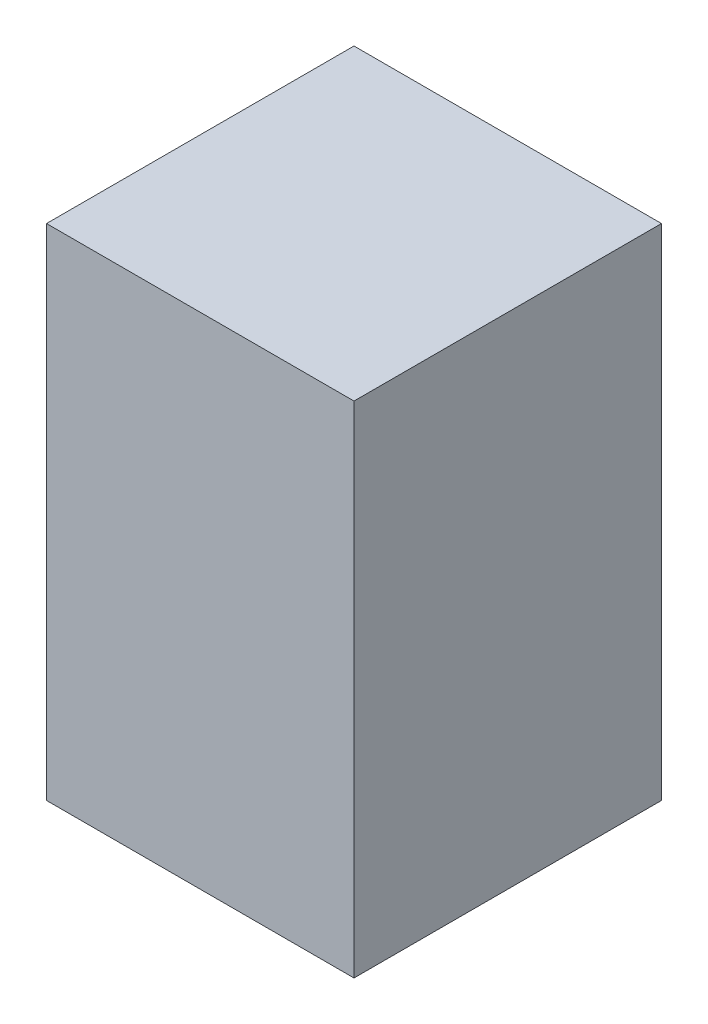
ISO-10303-21;
HEADER;
FILE_DESCRIPTION(('STEP AP214'),'2;1');
FILE_NAME('part.step','',(''),(''),'','','');
FILE_SCHEMA(('AUTOMOTIVE_DESIGN { 1 0 10303 214 1 1 1 1 }'));
ENDSEC;
DATA;
#1=APPLICATION_CONTEXT('core data for automotive mechanical design processes');
#2=APPLICATION_PROTOCOL_DEFINITION('international standard','automotive_design',2000,#1);
#3=PRODUCT_CONTEXT('',#1,'mechanical');
#4=PRODUCT('Part','Part','',(#3));
#5=PRODUCT_RELATED_PRODUCT_CATEGORY('part','',(#4));
#6=PRODUCT_DEFINITION_FORMATION('','',#4);
#7=PRODUCT_DEFINITION_CONTEXT('part definition',#1,'design');
#8=PRODUCT_DEFINITION('design','',#6,#7);
#9=PRODUCT_DEFINITION_SHAPE('','',#8);
#10=(LENGTH_UNIT() NAMED_UNIT(*) SI_UNIT(.MILLI.,.METRE.));
#11=(NAMED_UNIT(*) PLANE_ANGLE_UNIT() SI_UNIT($,.RADIAN.));
#12=(NAMED_UNIT(*) SI_UNIT($,.STERADIAN.) SOLID_ANGLE_UNIT());
#13=UNCERTAINTY_MEASURE_WITH_UNIT(LENGTH_MEASURE(1.E-05),#10,'distance_accuracy_value','');
#14=(GEOMETRIC_REPRESENTATION_CONTEXT(3) GLOBAL_UNCERTAINTY_ASSIGNED_CONTEXT((#13)) GLOBAL_UNIT_ASSIGNED_CONTEXT((#10,
#11,#12)) REPRESENTATION_CONTEXT('',''));
#15=CARTESIAN_POINT('',(0.,0.,0.));
#16=DIRECTION('',(0.,0.,1.));
#17=DIRECTION('',(1.,0.,0.));
#18=AXIS2_PLACEMENT_3D('',#15,#16,#17);
#19=CARTESIAN_POINT('',(-36.4561960120921,660.4,-352.08173204624));
#20=DIRECTION('',(1.,0.,0.));
#21=DIRECTION('',(0.,0.,-1.));
#22=AXIS2_PLACEMENT_3D('',#19,#20,#21);
#23=PLANE('',#22);
#24=DIRECTION('',(0.,0.,1.));
#25=VECTOR('',#24,1.);
#26=CARTESIAN_POINT('',(-36.4561960120921,0.,-352.08173204624));
#27=LINE('',#26,#25);
#28=CARTESIAN_POINT('',(-36.4561960120921,0.,-352.08173204624));
#29=VERTEX_POINT('',#28);
#30=CARTESIAN_POINT('',(-36.456196012092,0.,54.3182679537596));
#31=VERTEX_POINT('',#30);
#32=EDGE_CURVE('E94',#29,#31,#27,.T.);
#33=ORIENTED_EDGE('',*,*,#32,.T.);
#34=DIRECTION('',(0.,-1.,0.));
#35=VECTOR('',#34,1.);
#36=CARTESIAN_POINT('',(-36.456196012092,660.4,54.3182679537596));
#37=LINE('',#36,#35);
#38=CARTESIAN_POINT('',(-36.456196012092,660.4,54.3182679537596));
#39=VERTEX_POINT('',#38);
#40=EDGE_CURVE('E11',#39,#31,#37,.T.);
#41=ORIENTED_EDGE('',*,*,#40,.F.);
#42=DIRECTION('',(0.,0.,1.));
#43=VECTOR('',#42,1.);
#44=CARTESIAN_POINT('',(-36.4561960120921,660.4,-352.08173204624));
#45=LINE('',#44,#43);
#46=CARTESIAN_POINT('',(-36.4561960120921,660.4,-352.08173204624));
#47=VERTEX_POINT('',#46);
#48=EDGE_CURVE('E82',#47,#39,#45,.T.);
#49=ORIENTED_EDGE('',*,*,#48,.F.);
#50=DIRECTION('',(0.,-1.,0.));
#51=VECTOR('',#50,1.);
#52=CARTESIAN_POINT('',(-36.4561960120921,660.4,-352.08173204624));
#53=LINE('',#52,#51);
#54=EDGE_CURVE('E90',#47,#29,#53,.T.);
#55=ORIENTED_EDGE('',*,*,#54,.T.);
#56=EDGE_LOOP('',(#33,#41,#49,#55));
#57=FACE_BOUND('',#56,.T.);
#58=ADVANCED_FACE('F31',(#57),#23,.F.);
#59=CARTESIAN_POINT('',(-36.456196012092,660.4,54.3182679537596));
#60=DIRECTION('',(0.,0.,-1.));
#61=DIRECTION('',(-1.,0.,0.));
#62=AXIS2_PLACEMENT_3D('',#59,#60,#61);
#63=PLANE('',#62);
#64=DIRECTION('',(1.,0.,0.));
#65=VECTOR('',#64,1.);
#66=CARTESIAN_POINT('',(-36.456196012092,0.,54.3182679537596));
#67=LINE('',#66,#65);
#68=CARTESIAN_POINT('',(369.943803987908,0.,54.3182679537596));
#69=VERTEX_POINT('',#68);
#70=EDGE_CURVE('E86',#31,#69,#67,.T.);
#71=ORIENTED_EDGE('',*,*,#70,.T.);
#72=DIRECTION('',(0.,-1.,0.));
#73=VECTOR('',#72,1.);
#74=CARTESIAN_POINT('',(369.943803987908,660.4,54.3182679537596));
#75=LINE('',#74,#73);
#76=CARTESIAN_POINT('',(369.943803987908,660.4,54.3182679537596));
#77=VERTEX_POINT('',#76);
#78=EDGE_CURVE('E39',#77,#69,#75,.T.);
#79=ORIENTED_EDGE('',*,*,#78,.F.);
#80=DIRECTION('',(1.,0.,0.));
#81=VECTOR('',#80,1.);
#82=CARTESIAN_POINT('',(-36.456196012092,660.4,54.3182679537596));
#83=LINE('',#82,#81);
#84=EDGE_CURVE('E77',#39,#77,#83,.T.);
#85=ORIENTED_EDGE('',*,*,#84,.F.);
#86=ORIENTED_EDGE('',*,*,#40,.T.);
#87=EDGE_LOOP('',(#71,#79,#85,#86));
#88=FACE_BOUND('',#87,.T.);
#89=ADVANCED_FACE('F85',(#88),#63,.F.);
#90=CARTESIAN_POINT('',(369.943803987908,660.4,-352.08173204624));
#91=DIRECTION('',(-1.,0.,0.));
#92=DIRECTION('',(0.,0.,1.));
#93=AXIS2_PLACEMENT_3D('',#90,#91,#92);
#94=PLANE('',#93);
#95=DIRECTION('',(0.,0.,-1.));
#96=VECTOR('',#95,1.);
#97=CARTESIAN_POINT('',(369.943803987908,0.,-352.08173204624));
#98=LINE('',#97,#96);
#99=CARTESIAN_POINT('',(369.943803987908,0.,-352.08173204624));
#100=VERTEX_POINT('',#99);
#101=EDGE_CURVE('E64',#69,#100,#98,.T.);
#102=ORIENTED_EDGE('',*,*,#101,.T.);
#103=DIRECTION('',(0.,-1.,0.));
#104=VECTOR('',#103,1.);
#105=CARTESIAN_POINT('',(369.943803987908,660.4,-352.08173204624));
#106=LINE('',#105,#104);
#107=CARTESIAN_POINT('',(369.943803987908,660.4,-352.08173204624));
#108=VERTEX_POINT('',#107);
#109=EDGE_CURVE('E87',#108,#100,#106,.T.);
#110=ORIENTED_EDGE('',*,*,#109,.F.);
#111=DIRECTION('',(0.,0.,-1.));
#112=VECTOR('',#111,1.);
#113=CARTESIAN_POINT('',(369.943803987908,660.4,-352.08173204624));
#114=LINE('',#113,#112);
#115=EDGE_CURVE('E80',#77,#108,#114,.T.);
#116=ORIENTED_EDGE('',*,*,#115,.F.);
#117=ORIENTED_EDGE('',*,*,#78,.T.);
#118=EDGE_LOOP('',(#102,#110,#116,#117));
#119=FACE_BOUND('',#118,.T.);
#120=ADVANCED_FACE('F88',(#119),#94,.F.);
#121=CARTESIAN_POINT('',(-36.4561960120921,660.4,-352.08173204624));
#122=DIRECTION('',(0.,0.,1.));
#123=DIRECTION('',(1.,0.,0.));
#124=AXIS2_PLACEMENT_3D('',#121,#122,#123);
#125=PLANE('',#124);
#126=DIRECTION('',(-1.,0.,0.));
#127=VECTOR('',#126,1.);
#128=CARTESIAN_POINT('',(-36.4561960120921,0.,-352.08173204624));
#129=LINE('',#128,#127);
#130=EDGE_CURVE('E70',#100,#29,#129,.T.);
#131=ORIENTED_EDGE('',*,*,#130,.T.);
#132=ORIENTED_EDGE('',*,*,#54,.F.);
#133=DIRECTION('',(-1.,0.,0.));
#134=VECTOR('',#133,1.);
#135=CARTESIAN_POINT('',(-36.4561960120921,660.4,-352.08173204624));
#136=LINE('',#135,#134);
#137=EDGE_CURVE('E47',#108,#47,#136,.T.);
#138=ORIENTED_EDGE('',*,*,#137,.F.);
#139=ORIENTED_EDGE('',*,*,#109,.T.);
#140=EDGE_LOOP('',(#131,#132,#138,#139));
#141=FACE_BOUND('',#140,.T.);
#142=ADVANCED_FACE('F101',(#141),#125,.F.);
#143=CARTESIAN_POINT('',(-36.456196012092,660.4,54.3182679537596));
#144=DIRECTION('',(0.,1.,0.));
#145=DIRECTION('',(0.,0.,1.));
#146=AXIS2_PLACEMENT_3D('',#143,#144,#145);
#147=PLANE('',#146);
#148=ORIENTED_EDGE('',*,*,#48,.T.);
#149=ORIENTED_EDGE('',*,*,#84,.T.);
#150=ORIENTED_EDGE('',*,*,#115,.T.);
#151=ORIENTED_EDGE('',*,*,#137,.T.);
#152=EDGE_LOOP('',(#148,#149,#150,#151));
#153=FACE_BOUND('',#152,.T.);
#154=ADVANCED_FACE('F78',(#153),#147,.T.);
#155=CARTESIAN_POINT('',(-36.456196012092,0.,54.3182679537596));
#156=DIRECTION('',(0.,1.,0.));
#157=DIRECTION('',(0.,0.,1.));
#158=AXIS2_PLACEMENT_3D('',#155,#156,#157);
#159=PLANE('',#158);
#160=ORIENTED_EDGE('',*,*,#32,.F.);
#161=ORIENTED_EDGE('',*,*,#130,.F.);
#162=ORIENTED_EDGE('',*,*,#101,.F.);
#163=ORIENTED_EDGE('',*,*,#70,.F.);
#164=EDGE_LOOP('',(#160,#161,#162,#163));
#165=FACE_BOUND('',#164,.T.);
#166=ADVANCED_FACE('F104',(#165),#159,.F.);
#167=CLOSED_SHELL('',(#58,#89,#120,#142,#154,#166));
#168=MANIFOLD_SOLID_BREP('B2',#167);
#169=ADVANCED_BREP_SHAPE_REPRESENTATION('',(#18,#168),#14);
#170=SHAPE_DEFINITION_REPRESENTATION(#9,#169);
ENDSEC;
END-ISO-10303-21;
